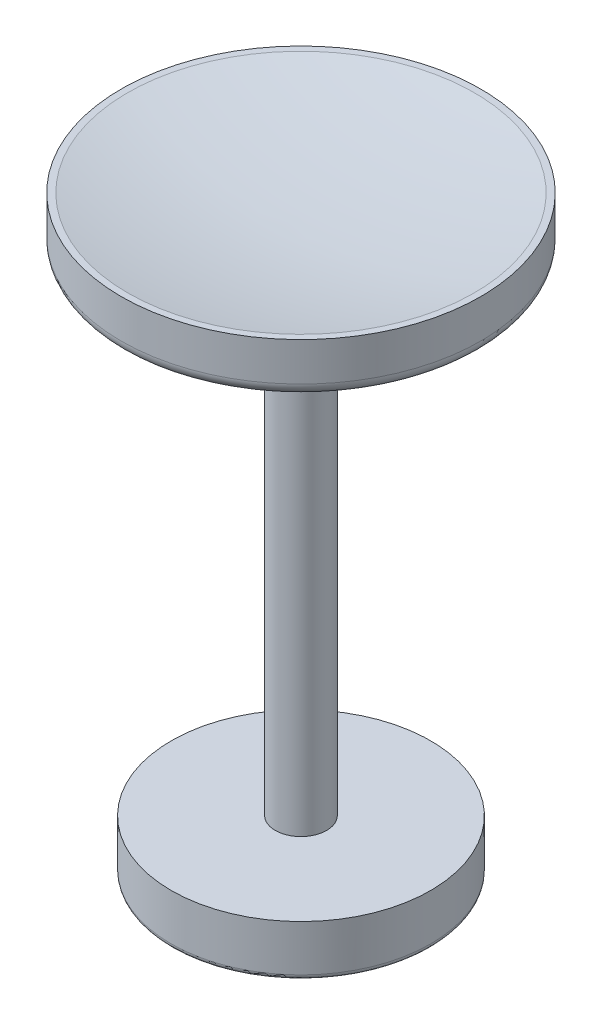
ISO-10303-21;
HEADER;
FILE_DESCRIPTION(('STEP AP214'),'2;1');
FILE_NAME('part.step','',(''),(''),'','','');
FILE_SCHEMA(('AUTOMOTIVE_DESIGN { 1 0 10303 214 1 1 1 1 }'));
ENDSEC;
DATA;
#1=APPLICATION_CONTEXT('core data for automotive mechanical design processes');
#2=APPLICATION_PROTOCOL_DEFINITION('international standard','automotive_design',2000,#1);
#3=PRODUCT_CONTEXT('',#1,'mechanical');
#4=PRODUCT('Part','Part','',(#3));
#5=PRODUCT_RELATED_PRODUCT_CATEGORY('part','',(#4));
#6=PRODUCT_DEFINITION_FORMATION('','',#4);
#7=PRODUCT_DEFINITION_CONTEXT('part definition',#1,'design');
#8=PRODUCT_DEFINITION('design','',#6,#7);
#9=PRODUCT_DEFINITION_SHAPE('','',#8);
#10=(LENGTH_UNIT() NAMED_UNIT(*) SI_UNIT(.MILLI.,.METRE.));
#11=(NAMED_UNIT(*) PLANE_ANGLE_UNIT() SI_UNIT($,.RADIAN.));
#12=(NAMED_UNIT(*) SI_UNIT($,.STERADIAN.) SOLID_ANGLE_UNIT());
#13=UNCERTAINTY_MEASURE_WITH_UNIT(LENGTH_MEASURE(1.E-05),#10,'distance_accuracy_value','');
#14=(GEOMETRIC_REPRESENTATION_CONTEXT(3) GLOBAL_UNCERTAINTY_ASSIGNED_CONTEXT((#13)) GLOBAL_UNIT_ASSIGNED_CONTEXT((#10,
#11,#12)) REPRESENTATION_CONTEXT('',''));
#15=CARTESIAN_POINT('',(0.,0.,0.));
#16=DIRECTION('',(0.,0.,1.));
#17=DIRECTION('',(1.,0.,0.));
#18=AXIS2_PLACEMENT_3D('',#15,#16,#17);
#19=CARTESIAN_POINT('',(0.,2.54,0.));
#20=DIRECTION('',(0.,-1.,0.));
#21=DIRECTION('',(0.,0.,-1.));
#22=AXIS2_PLACEMENT_3D('',#19,#20,#21);
#23=CYLINDRICAL_SURFACE('',#22,17.78);
#24=CARTESIAN_POINT('',(0.,1.27,0.));
#25=DIRECTION('',(0.,1.,0.));
#26=DIRECTION('',(0.,0.,1.));
#27=AXIS2_PLACEMENT_3D('',#24,#25,#26);
#28=CIRCLE('',#27,17.78);
#29=CARTESIAN_POINT('',(0.,1.27,17.78));
#30=VERTEX_POINT('',#29);
#31=EDGE_CURVE('E40',#30,#30,#28,.T.);
#32=ORIENTED_EDGE('',*,*,#31,.T.);
#33=EDGE_LOOP('',(#32));
#34=FACE_BOUND('',#33,.T.);
#35=CARTESIAN_POINT('',(0.,5.08,0.));
#36=DIRECTION('',(0.,1.,0.));
#37=DIRECTION('',(0.,0.,1.));
#38=AXIS2_PLACEMENT_3D('',#35,#36,#37);
#39=CIRCLE('',#38,17.78);
#40=CARTESIAN_POINT('',(0.,5.08,17.78));
#41=VERTEX_POINT('',#40);
#42=EDGE_CURVE('E56',#41,#41,#39,.T.);
#43=ORIENTED_EDGE('',*,*,#42,.F.);
#44=EDGE_LOOP('',(#43));
#45=FACE_BOUND('',#44,.T.);
#46=ADVANCED_FACE('F33',(#34,#45),#23,.T.);
#47=CARTESIAN_POINT('',(0.,0.,0.));
#48=DIRECTION('',(0.,1.,0.));
#49=DIRECTION('',(0.,0.,1.));
#50=AXIS2_PLACEMENT_3D('',#47,#48,#49);
#51=PLANE('',#50);
#52=CARTESIAN_POINT('',(0.,0.,0.));
#53=DIRECTION('',(0.,1.,0.));
#54=DIRECTION('',(0.,0.,1.));
#55=AXIS2_PLACEMENT_3D('',#52,#53,#54);
#56=CIRCLE('',#55,16.51);
#57=CARTESIAN_POINT('',(0.,0.,16.51));
#58=VERTEX_POINT('',#57);
#59=EDGE_CURVE('E10',#58,#58,#56,.F.);
#60=ORIENTED_EDGE('',*,*,#59,.T.);
#61=EDGE_LOOP('',(#60));
#62=FACE_BOUND('',#61,.T.);
#63=CARTESIAN_POINT('',(0.,0.,0.));
#64=DIRECTION('',(0.,1.,0.));
#65=DIRECTION('',(0.,0.,1.));
#66=AXIS2_PLACEMENT_3D('',#63,#64,#65);
#67=CIRCLE('',#66,2.54);
#68=CARTESIAN_POINT('',(0.,0.,2.54));
#69=VERTEX_POINT('',#68);
#70=EDGE_CURVE('E65',#69,#69,#67,.T.);
#71=ORIENTED_EDGE('',*,*,#70,.T.);
#72=EDGE_LOOP('',(#71));
#73=FACE_BOUND('',#72,.T.);
#74=ADVANCED_FACE('F69',(#62,#73),#51,.F.);
#75=CARTESIAN_POINT('',(0.,81.2800000000001,0.));
#76=DIRECTION('',(0.,1.,0.));
#77=DIRECTION('',(0.,0.,1.));
#78=AXIS2_PLACEMENT_3D('',#75,#76,#77);
#79=SPHERICAL_SURFACE('',#78,78.1050000000001);
#80=CARTESIAN_POINT('',(0.,5.08,0.));
#81=DIRECTION('',(0.,1.,0.));
#82=DIRECTION('',(0.,0.,1.));
#83=AXIS2_PLACEMENT_3D('',#80,#81,#82);
#84=CIRCLE('',#83,17.145);
#85=CARTESIAN_POINT('',(0.,5.08,17.145));
#86=VERTEX_POINT('',#85);
#87=EDGE_CURVE('E53',#86,#86,#84,.T.);
#88=ORIENTED_EDGE('',*,*,#87,.T.);
#89=EDGE_LOOP('',(#88));
#90=FACE_BOUND('',#89,.T.);
#91=ADVANCED_FACE('F90',(#90),#79,.F.);
#92=CARTESIAN_POINT('',(0.,5.08,17.78));
#93=DIRECTION('',(0.,1.,0.));
#94=DIRECTION('',(0.,0.,1.));
#95=AXIS2_PLACEMENT_3D('',#92,#93,#94);
#96=PLANE('',#95);
#97=ORIENTED_EDGE('',*,*,#42,.T.);
#98=EDGE_LOOP('',(#97));
#99=FACE_BOUND('',#98,.T.);
#100=ORIENTED_EDGE('',*,*,#87,.F.);
#101=EDGE_LOOP('',(#100));
#102=FACE_BOUND('',#101,.T.);
#103=ADVANCED_FACE('F96',(#99,#102),#96,.T.);
#104=CARTESIAN_POINT('',(0.,-53.34,0.));
#105=DIRECTION('',(0.,-1.,0.));
#106=DIRECTION('',(0.,0.,-1.));
#107=AXIS2_PLACEMENT_3D('',#104,#105,#106);
#108=PLANE('',#107);
#109=CARTESIAN_POINT('',(0.,-53.34,0.));
#110=DIRECTION('',(0.,-1.,0.));
#111=DIRECTION('',(0.,0.,-1.));
#112=AXIS2_PLACEMENT_3D('',#109,#110,#111);
#113=CIRCLE('',#112,12.319);
#114=CARTESIAN_POINT('',(0.,-53.34,-12.319));
#115=VERTEX_POINT('',#114);
#116=EDGE_CURVE('E44',#115,#115,#113,.T.);
#117=ORIENTED_EDGE('',*,*,#116,.T.);
#118=EDGE_LOOP('',(#117));
#119=FACE_BOUND('',#118,.T.);
#120=ADVANCED_FACE('F100',(#119),#108,.T.);
#121=CARTESIAN_POINT('',(0.,0.,0.));
#122=DIRECTION('',(0.,1.,0.));
#123=DIRECTION('',(0.,0.,1.));
#124=AXIS2_PLACEMENT_3D('',#121,#122,#123);
#125=CYLINDRICAL_SURFACE('',#124,12.827);
#126=CARTESIAN_POINT('',(0.,-52.832,0.));
#127=DIRECTION('',(0.,-1.,0.));
#128=DIRECTION('',(0.,0.,-1.));
#129=AXIS2_PLACEMENT_3D('',#126,#127,#128);
#130=CIRCLE('',#129,12.827);
#131=CARTESIAN_POINT('',(0.,-52.832,-12.827));
#132=VERTEX_POINT('',#131);
#133=EDGE_CURVE('E48',#132,#132,#130,.F.);
#134=ORIENTED_EDGE('',*,*,#133,.T.);
#135=EDGE_LOOP('',(#134));
#136=FACE_BOUND('',#135,.T.);
#137=CARTESIAN_POINT('',(0.,-48.26,0.));
#138=DIRECTION('',(0.,1.,0.));
#139=DIRECTION('',(0.,0.,1.));
#140=AXIS2_PLACEMENT_3D('',#137,#138,#139);
#141=CIRCLE('',#140,12.827);
#142=CARTESIAN_POINT('',(0.,-48.26,12.827));
#143=VERTEX_POINT('',#142);
#144=EDGE_CURVE('E59',#143,#143,#141,.T.);
#145=ORIENTED_EDGE('',*,*,#144,.F.);
#146=EDGE_LOOP('',(#145));
#147=FACE_BOUND('',#146,.T.);
#148=ADVANCED_FACE('F82',(#136,#147),#125,.T.);
#149=CARTESIAN_POINT('',(0.,-48.26,12.827));
#150=DIRECTION('',(0.,1.,0.));
#151=DIRECTION('',(0.,0.,1.));
#152=AXIS2_PLACEMENT_3D('',#149,#150,#151);
#153=PLANE('',#152);
#154=ORIENTED_EDGE('',*,*,#144,.T.);
#155=EDGE_LOOP('',(#154));
#156=FACE_BOUND('',#155,.T.);
#157=CARTESIAN_POINT('',(0.,-48.26,0.));
#158=DIRECTION('',(0.,1.,0.));
#159=DIRECTION('',(0.,0.,1.));
#160=AXIS2_PLACEMENT_3D('',#157,#158,#159);
#161=CIRCLE('',#160,2.54000000000001);
#162=CARTESIAN_POINT('',(0.,-48.26,2.54));
#163=VERTEX_POINT('',#162);
#164=EDGE_CURVE('E62',#163,#163,#161,.T.);
#165=ORIENTED_EDGE('',*,*,#164,.F.);
#166=EDGE_LOOP('',(#165));
#167=FACE_BOUND('',#166,.T.);
#168=ADVANCED_FACE('F74',(#156,#167),#153,.T.);
#169=CARTESIAN_POINT('',(0.,0.,0.));
#170=DIRECTION('',(0.,1.,0.));
#171=DIRECTION('',(0.,0.,1.));
#172=AXIS2_PLACEMENT_3D('',#169,#170,#171);
#173=CYLINDRICAL_SURFACE('',#172,2.54);
#174=ORIENTED_EDGE('',*,*,#164,.T.);
#175=EDGE_LOOP('',(#174));
#176=FACE_BOUND('',#175,.T.);
#177=ORIENTED_EDGE('',*,*,#70,.F.);
#178=EDGE_LOOP('',(#177));
#179=FACE_BOUND('',#178,.T.);
#180=ADVANCED_FACE('F71',(#176,#179),#173,.T.);
#181=CARTESIAN_POINT('',(0.,-52.832,0.));
#182=DIRECTION('',(0.,-1.,0.));
#183=DIRECTION('',(0.,0.,-1.));
#184=AXIS2_PLACEMENT_3D('',#181,#182,#183);
#185=TOROIDAL_SURFACE('',#184,12.319,0.508);
#186=ORIENTED_EDGE('',*,*,#116,.F.);
#187=EDGE_LOOP('',(#186));
#188=FACE_BOUND('',#187,.T.);
#189=ORIENTED_EDGE('',*,*,#133,.F.);
#190=EDGE_LOOP('',(#189));
#191=FACE_BOUND('',#190,.T.);
#192=ADVANCED_FACE('F73',(#188,#191),#185,.T.);
#193=CARTESIAN_POINT('',(0.,1.27,0.));
#194=DIRECTION('',(0.,1.,0.));
#195=DIRECTION('',(0.,0.,1.));
#196=AXIS2_PLACEMENT_3D('',#193,#194,#195);
#197=TOROIDAL_SURFACE('',#196,16.51,1.27);
#198=ORIENTED_EDGE('',*,*,#59,.F.);
#199=EDGE_LOOP('',(#198));
#200=FACE_BOUND('',#199,.T.);
#201=ORIENTED_EDGE('',*,*,#31,.F.);
#202=EDGE_LOOP('',(#201));
#203=FACE_BOUND('',#202,.T.);
#204=ADVANCED_FACE('F35',(#200,#203),#197,.T.);
#205=CLOSED_SHELL('',(#46,#74,#91,#103,#120,#148,#168,#180,#192,#204));
#206=MANIFOLD_SOLID_BREP('B2',#205);
#207=ADVANCED_BREP_SHAPE_REPRESENTATION('',(#18,#206),#14);
#208=SHAPE_DEFINITION_REPRESENTATION(#9,#207);
ENDSEC;
END-ISO-10303-21;
